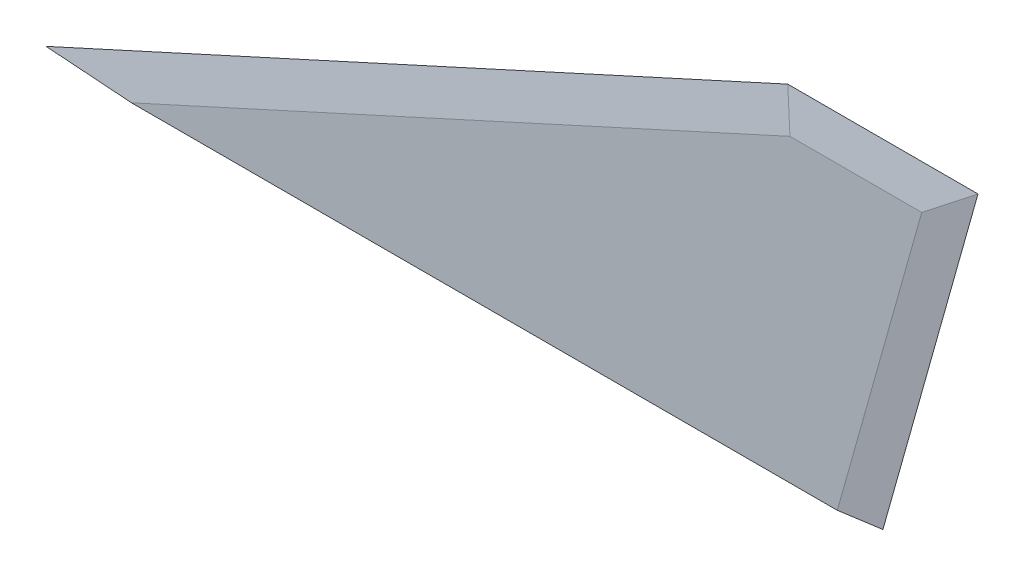
ISO-10303-21;
HEADER;
FILE_DESCRIPTION(('STEP AP214'),'2;1');
FILE_NAME('part.step','',(''),(''),'','','');
FILE_SCHEMA(('AUTOMOTIVE_DESIGN { 1 0 10303 214 1 1 1 1 }'));
ENDSEC;
DATA;
#1=APPLICATION_CONTEXT('core data for automotive mechanical design processes');
#2=APPLICATION_PROTOCOL_DEFINITION('international standard','automotive_design',2000,#1);
#3=PRODUCT_CONTEXT('',#1,'mechanical');
#4=PRODUCT('Part','Part','',(#3));
#5=PRODUCT_RELATED_PRODUCT_CATEGORY('part','',(#4));
#6=PRODUCT_DEFINITION_FORMATION('','',#4);
#7=PRODUCT_DEFINITION_CONTEXT('part definition',#1,'design');
#8=PRODUCT_DEFINITION('design','',#6,#7);
#9=PRODUCT_DEFINITION_SHAPE('','',#8);
#10=(LENGTH_UNIT() NAMED_UNIT(*) SI_UNIT(.MILLI.,.METRE.));
#11=(NAMED_UNIT(*) PLANE_ANGLE_UNIT() SI_UNIT($,.RADIAN.));
#12=(NAMED_UNIT(*) SI_UNIT($,.STERADIAN.) SOLID_ANGLE_UNIT());
#13=UNCERTAINTY_MEASURE_WITH_UNIT(LENGTH_MEASURE(1.E-05),#10,'distance_accuracy_value','');
#14=(GEOMETRIC_REPRESENTATION_CONTEXT(3) GLOBAL_UNCERTAINTY_ASSIGNED_CONTEXT((#13)) GLOBAL_UNIT_ASSIGNED_CONTEXT((#10,
#11,#12)) REPRESENTATION_CONTEXT('',''));
#15=CARTESIAN_POINT('',(0.,0.,0.));
#16=DIRECTION('',(0.,0.,1.));
#17=DIRECTION('',(1.,0.,0.));
#18=AXIS2_PLACEMENT_3D('',#15,#16,#17);
#19=CARTESIAN_POINT('',(194.250441082254,-54.6261082908477,1.59));
#20=DIRECTION('',(-0.151164039071009,0.0425095722921847,-0.987594233253351));
#21=DIRECTION('',(0.270714218023585,0.962659759291869,0.));
#22=AXIS2_PLACEMENT_3D('',#19,#20,#21);
#23=PLANE('',#22);
#24=DIRECTION('',(0.270714218023585,0.962659759291869,0.));
#25=VECTOR('',#24,1.);
#26=CARTESIAN_POINT('',(194.250441082254,-54.6261082908477,1.59));
#27=LINE('',#26,#25);
#28=CARTESIAN_POINT('',(209.612113829962,0.,1.59));
#29=VERTEX_POINT('',#28);
#30=CARTESIAN_POINT('',(231.799965348522,78.8999999999998,1.59));
#31=VERTEX_POINT('',#30);
#32=EDGE_CURVE('E127',#29,#31,#27,.T.);
#33=ORIENTED_EDGE('',*,*,#32,.F.);
#34=CARTESIAN_POINT('',(208.478864479253,-40.9691579117755,0.));
#35=DIRECTION('',(-0.151164039071009,0.0425095722921847,-0.987594233253351));
#36=DIRECTION('',(-0.98850869156105,-0.00650061926791954,0.15102419891327));
#37=AXIS2_PLACEMENT_3D('',#34,#35,#36);
#38=ELLIPSE('',#37,271.228529298164,41.);
#39=CARTESIAN_POINT('',(220.,0.0308420667318315,0.00132755237042736));
#40=VERTEX_POINT('',#39);
#41=EDGE_CURVE('E111',#29,#40,#38,.T.);
#42=ORIENTED_EDGE('',*,*,#41,.T.);
#43=DIRECTION('',(0.,-0.999074911211701,-0.0430037415503689));
#44=VECTOR('',#43,1.);
#45=CARTESIAN_POINT('',(220.,-54.4567743433871,-2.3440134701106));
#46=LINE('',#45,#44);
#47=CARTESIAN_POINT('',(220.,0.,0.));
#48=VERTEX_POINT('',#47);
#49=EDGE_CURVE('E116',#48,#40,#46,.F.);
#50=ORIENTED_EDGE('',*,*,#49,.F.);
#51=DIRECTION('',(-0.270714218023585,-0.962659759291869,0.));
#52=VECTOR('',#51,1.);
#53=CARTESIAN_POINT('',(220.,0.,0.));
#54=LINE('',#53,#52);
#55=CARTESIAN_POINT('',(245.,88.9,0.));
#56=VERTEX_POINT('',#55);
#57=EDGE_CURVE('E120',#56,#48,#54,.T.);
#58=ORIENTED_EDGE('',*,*,#57,.F.);
#59=DIRECTION('',(0.793444104141409,0.601092440354001,-0.0955736980162843));
#60=VECTOR('',#59,1.);
#61=CARTESIAN_POINT('',(85.869475108713,-31.6531114825316,19.1679447257222));
#62=LINE('',#61,#60);
#63=EDGE_CURVE('E138',#56,#31,#62,.F.);
#64=ORIENTED_EDGE('',*,*,#63,.T.);
#65=EDGE_LOOP('',(#33,#42,#50,#58,#64));
#66=FACE_BOUND('',#65,.T.);
#67=ADVANCED_FACE('F42',(#66),#23,.F.);
#68=CARTESIAN_POINT('',(220.,0.,0.));
#69=DIRECTION('',(0.151164039071009,-0.0425095722921848,-0.987594233253351));
#70=DIRECTION('',(-0.270714218023585,-0.962659759291869,0.));
#71=AXIS2_PLACEMENT_3D('',#68,#69,#70);
#72=PLANE('',#71);
#73=DIRECTION('',(0.,-0.999074911211702,0.043003741550369));
#74=VECTOR('',#73,1.);
#75=CARTESIAN_POINT('',(220.,0.,0.));
#76=LINE('',#75,#74);
#77=CARTESIAN_POINT('',(220.,0.0308420667318385,-0.00132755237042086));
#78=VERTEX_POINT('',#77);
#79=EDGE_CURVE('E11',#78,#48,#76,.T.);
#80=ORIENTED_EDGE('',*,*,#79,.F.);
#81=CARTESIAN_POINT('',(208.478864479253,-40.9691579117755,0.));
#82=DIRECTION('',(0.151164039071009,-0.0425095722921848,-0.987594233253351));
#83=DIRECTION('',(-0.98850869156105,-0.00650061926791956,-0.151024198913271));
#84=AXIS2_PLACEMENT_3D('',#81,#82,#83);
#85=ELLIPSE('',#84,271.228529298164,41.);
#86=CARTESIAN_POINT('',(209.612113829962,0.,-1.59));
#87=VERTEX_POINT('',#86);
#88=EDGE_CURVE('E101',#78,#87,#85,.F.);
#89=ORIENTED_EDGE('',*,*,#88,.T.);
#90=DIRECTION('',(-0.270714218023585,-0.962659759291869,0.));
#91=VECTOR('',#90,1.);
#92=CARTESIAN_POINT('',(210.373402407081,2.70714218023591,-1.59));
#93=LINE('',#92,#91);
#94=CARTESIAN_POINT('',(231.799965348522,78.8999999999998,-1.59));
#95=VERTEX_POINT('',#94);
#96=EDGE_CURVE('E137',#95,#87,#93,.T.);
#97=ORIENTED_EDGE('',*,*,#96,.F.);
#98=DIRECTION('',(0.793444104141409,0.601092440354001,0.0955736980162843));
#99=VECTOR('',#98,1.);
#100=CARTESIAN_POINT('',(186.861795162351,44.8560210463989,-7.00299265362243));
#101=LINE('',#100,#99);
#102=EDGE_CURVE('E122',#56,#95,#101,.F.);
#103=ORIENTED_EDGE('',*,*,#102,.F.);
#104=ORIENTED_EDGE('',*,*,#57,.T.);
#105=EDGE_LOOP('',(#80,#89,#97,#103,#104));
#106=FACE_BOUND('',#105,.T.);
#107=ADVANCED_FACE('F45',(#106),#72,.T.);
#108=CARTESIAN_POINT('',(0.,0.,1.59));
#109=DIRECTION('',(0.,0.,-1.));
#110=DIRECTION('',(-1.,0.,0.));
#111=AXIS2_PLACEMENT_3D('',#108,#109,#110);
#112=PLANE('',#111);
#113=DIRECTION('',(1.,0.,0.));
#114=VECTOR('',#113,1.);
#115=CARTESIAN_POINT('',(0.,0.,1.59));
#116=LINE('',#115,#114);
#117=CARTESIAN_POINT('',(24.1067130759977,0.,1.59));
#118=VERTEX_POINT('',#117);
#119=EDGE_CURVE('E167',#118,#29,#116,.T.);
#120=ORIENTED_EDGE('',*,*,#119,.T.);
#121=ORIENTED_EDGE('',*,*,#32,.T.);
#122=DIRECTION('',(-1.,0.,0.));
#123=VECTOR('',#122,1.);
#124=CARTESIAN_POINT('',(0.,78.8999999999998,1.59));
#125=LINE('',#124,#123);
#126=CARTESIAN_POINT('',(197.171954920767,78.8999999999998,1.59));
#127=VERTEX_POINT('',#126);
#128=EDGE_CURVE('E132',#31,#127,#125,.T.);
#129=ORIENTED_EDGE('',*,*,#128,.T.);
#130=DIRECTION('',(-0.909902485920853,-0.41482221024802,0.));
#131=VECTOR('',#130,1.);
#132=CARTESIAN_POINT('',(4.14822210248029,-9.09902485920873,1.59));
#133=LINE('',#132,#131);
#134=EDGE_CURVE('E159',#127,#118,#133,.T.);
#135=ORIENTED_EDGE('',*,*,#134,.T.);
#136=EDGE_LOOP('',(#120,#121,#129,#135));
#137=FACE_BOUND('',#136,.T.);
#138=ADVANCED_FACE('F174',(#137),#112,.F.);
#139=CARTESIAN_POINT('',(0.,0.,-1.59));
#140=DIRECTION('',(0.,0.,-1.));
#141=DIRECTION('',(-1.,0.,0.));
#142=AXIS2_PLACEMENT_3D('',#139,#140,#141);
#143=PLANE('',#142);
#144=DIRECTION('',(1.,0.,0.));
#145=VECTOR('',#144,1.);
#146=CARTESIAN_POINT('',(0.,0.,-1.59));
#147=LINE('',#146,#145);
#148=CARTESIAN_POINT('',(24.1067130759979,0.,-1.59));
#149=VERTEX_POINT('',#148);
#150=EDGE_CURVE('E106',#149,#87,#147,.T.);
#151=ORIENTED_EDGE('',*,*,#150,.F.);
#152=DIRECTION('',(0.909902485920853,0.41482221024802,0.));
#153=VECTOR('',#152,1.);
#154=CARTESIAN_POINT('',(199.14822210248,79.8009751407912,-1.59));
#155=LINE('',#154,#153);
#156=CARTESIAN_POINT('',(197.171954920767,78.8999999999998,-1.59));
#157=VERTEX_POINT('',#156);
#158=EDGE_CURVE('E66',#149,#157,#155,.T.);
#159=ORIENTED_EDGE('',*,*,#158,.T.);
#160=DIRECTION('',(1.,0.,0.));
#161=VECTOR('',#160,1.);
#162=CARTESIAN_POINT('',(245.,78.8999999999998,-1.59));
#163=LINE('',#162,#161);
#164=EDGE_CURVE('E144',#157,#95,#163,.T.);
#165=ORIENTED_EDGE('',*,*,#164,.T.);
#166=ORIENTED_EDGE('',*,*,#96,.T.);
#167=EDGE_LOOP('',(#151,#159,#165,#166));
#168=FACE_BOUND('',#167,.T.);
#169=ADVANCED_FACE('F166',(#168),#143,.T.);
#170=CARTESIAN_POINT('',(4.14822210248029,-9.09902485920873,1.59));
#171=DIRECTION('',(0.0651384876039488,-0.14287969721901,-0.987594233253351));
#172=DIRECTION('',(-0.909902485920853,-0.41482221024802,0.));
#173=AXIS2_PLACEMENT_3D('',#170,#171,#172);
#174=PLANE('',#173);
#175=DIRECTION('',(0.909902485920853,0.41482221024802,0.));
#176=VECTOR('',#175,1.);
#177=CARTESIAN_POINT('',(195.,88.9,0.));
#178=LINE('',#177,#176);
#179=CARTESIAN_POINT('',(0.0676513746205865,0.0308420882244587,0.));
#180=VERTEX_POINT('',#179);
#181=CARTESIAN_POINT('',(195.,88.9,0.));
#182=VERTEX_POINT('',#181);
#183=EDGE_CURVE('E129',#180,#182,#178,.T.);
#184=ORIENTED_EDGE('',*,*,#183,.F.);
#185=CARTESIAN_POINT('',(-89.8648570618248,-40.9691579117755,0.));
#186=DIRECTION('',(0.0651384876039488,-0.14287969721901,-0.987594233253351));
#187=DIRECTION('',(-0.997876233524314,-0.00932677527881988,-0.0644673082284982));
#188=AXIS2_PLACEMENT_3D('',#185,#186,#187);
#189=ELLIPSE('',#188,629.428184597803,41.);
#190=EDGE_CURVE('E58',#180,#118,#189,.T.);
#191=ORIENTED_EDGE('',*,*,#190,.T.);
#192=ORIENTED_EDGE('',*,*,#134,.F.);
#193=DIRECTION('',(-0.209730354991244,0.965629410564436,-0.153535076279742));
#194=VECTOR('',#193,1.);
#195=CARTESIAN_POINT('',(206.503175211888,35.9376889414118,8.42100745831537));
#196=LINE('',#195,#194);
#197=EDGE_CURVE('E140',#182,#127,#196,.F.);
#198=ORIENTED_EDGE('',*,*,#197,.F.);
#199=EDGE_LOOP('',(#184,#191,#192,#198));
#200=FACE_BOUND('',#199,.T.);
#201=ADVANCED_FACE('F155',(#200),#174,.F.);
#202=CARTESIAN_POINT('',(0.,78.8999999999998,1.59));
#203=DIRECTION('',(0.,-0.15702748308728,-0.987594233253351));
#204=DIRECTION('',(-1.,0.,0.));
#205=AXIS2_PLACEMENT_3D('',#202,#203,#204);
#206=PLANE('',#205);
#207=ORIENTED_EDGE('',*,*,#197,.T.);
#208=ORIENTED_EDGE('',*,*,#128,.F.);
#209=ORIENTED_EDGE('',*,*,#63,.F.);
#210=DIRECTION('',(1.,0.,0.));
#211=VECTOR('',#210,1.);
#212=CARTESIAN_POINT('',(245.,88.9,0.));
#213=LINE('',#212,#211);
#214=EDGE_CURVE('E126',#182,#56,#213,.T.);
#215=ORIENTED_EDGE('',*,*,#214,.F.);
#216=EDGE_LOOP('',(#207,#208,#209,#215));
#217=FACE_BOUND('',#216,.T.);
#218=ADVANCED_FACE('F163',(#217),#206,.F.);
#219=CARTESIAN_POINT('',(245.,88.9,0.));
#220=DIRECTION('',(0.,0.15702748308728,-0.987594233253351));
#221=DIRECTION('',(1.,0.,0.));
#222=AXIS2_PLACEMENT_3D('',#219,#220,#221);
#223=PLANE('',#222);
#224=ORIENTED_EDGE('',*,*,#102,.T.);
#225=ORIENTED_EDGE('',*,*,#164,.F.);
#226=DIRECTION('',(-0.209730354991246,0.965629410564436,0.153535076279742));
#227=VECTOR('',#226,1.);
#228=CARTESIAN_POINT('',(197.199341090238,78.7739100466167,-1.61004830258791));
#229=LINE('',#228,#227);
#230=EDGE_CURVE('E147',#182,#157,#229,.F.);
#231=ORIENTED_EDGE('',*,*,#230,.F.);
#232=ORIENTED_EDGE('',*,*,#214,.T.);
#233=EDGE_LOOP('',(#224,#225,#231,#232));
#234=FACE_BOUND('',#233,.T.);
#235=ADVANCED_FACE('F165',(#234),#223,.T.);
#236=CARTESIAN_POINT('',(195.,88.9,0.));
#237=DIRECTION('',(-0.0651384876039487,0.14287969721901,-0.987594233253351));
#238=DIRECTION('',(0.909902485920853,0.41482221024802,0.));
#239=AXIS2_PLACEMENT_3D('',#236,#237,#238);
#240=PLANE('',#239);
#241=ORIENTED_EDGE('',*,*,#158,.F.);
#242=CARTESIAN_POINT('',(-89.8648570618248,-40.9691579117755,0.));
#243=DIRECTION('',(-0.0651384876039487,0.14287969721901,-0.987594233253351));
#244=DIRECTION('',(-0.997876233524314,-0.00932677527881986,0.0644673082284981));
#245=AXIS2_PLACEMENT_3D('',#242,#243,#244);
#246=ELLIPSE('',#245,629.428184597804,41.);
#247=EDGE_CURVE('E51',#149,#180,#246,.F.);
#248=ORIENTED_EDGE('',*,*,#247,.T.);
#249=ORIENTED_EDGE('',*,*,#183,.T.);
#250=ORIENTED_EDGE('',*,*,#230,.T.);
#251=EDGE_LOOP('',(#241,#248,#249,#250));
#252=FACE_BOUND('',#251,.T.);
#253=ADVANCED_FACE('F152',(#252),#240,.T.);
#254=CARTESIAN_POINT('',(220.,-40.9691579117755,0.));
#255=DIRECTION('',(-1.,0.,0.));
#256=DIRECTION('',(0.,0.,1.));
#257=AXIS2_PLACEMENT_3D('',#254,#255,#256);
#258=CYLINDRICAL_SURFACE('',#257,41.);
#259=ORIENTED_EDGE('',*,*,#119,.F.);
#260=ORIENTED_EDGE('',*,*,#190,.F.);
#261=ORIENTED_EDGE('',*,*,#247,.F.);
#262=ORIENTED_EDGE('',*,*,#150,.T.);
#263=ORIENTED_EDGE('',*,*,#88,.F.);
#264=CARTESIAN_POINT('',(220.,-40.9691579117755,0.));
#265=DIRECTION('',(1.,0.,0.));
#266=DIRECTION('',(0.,0.,-1.));
#267=AXIS2_PLACEMENT_3D('',#264,#265,#266);
#268=CIRCLE('',#267,41.);
#269=EDGE_CURVE('E104',#78,#40,#268,.T.);
#270=ORIENTED_EDGE('',*,*,#269,.T.);
#271=ORIENTED_EDGE('',*,*,#41,.F.);
#272=EDGE_LOOP('',(#259,#260,#261,#262,#263,#270,#271));
#273=FACE_BOUND('',#272,.T.);
#274=ADVANCED_FACE('F103',(#273),#258,.F.);
#275=CARTESIAN_POINT('',(220.,-40.9691579117755,0.));
#276=DIRECTION('',(1.,0.,0.));
#277=DIRECTION('',(0.,0.,-1.));
#278=AXIS2_PLACEMENT_3D('',#275,#276,#277);
#279=PLANE('',#278);
#280=ORIENTED_EDGE('',*,*,#49,.T.);
#281=ORIENTED_EDGE('',*,*,#269,.F.);
#282=ORIENTED_EDGE('',*,*,#79,.T.);
#283=EDGE_LOOP('',(#280,#281,#282));
#284=FACE_BOUND('',#283,.T.);
#285=ADVANCED_FACE('F114',(#284),#279,.F.);
#286=CLOSED_SHELL('',(#67,#107,#138,#169,#201,#218,#235,#253,#274,#285));
#287=MANIFOLD_SOLID_BREP('B2',#286);
#288=ADVANCED_BREP_SHAPE_REPRESENTATION('',(#18,#287),#14);
#289=SHAPE_DEFINITION_REPRESENTATION(#9,#288);
ENDSEC;
END-ISO-10303-21;
